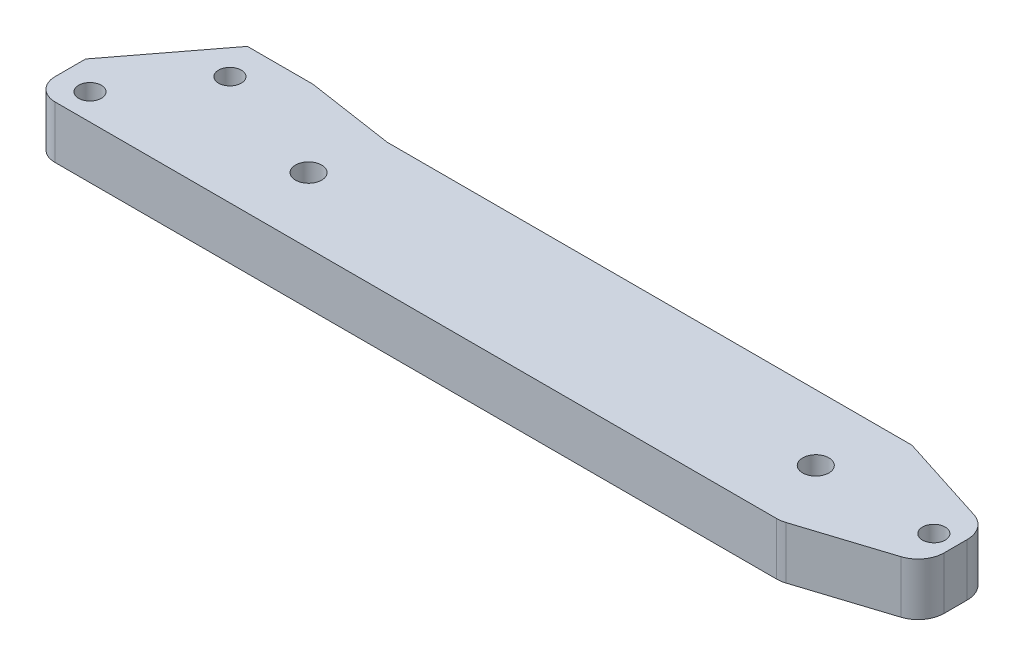
ISO-10303-21;
HEADER;
FILE_DESCRIPTION(('STEP AP214'),'2;1');
FILE_NAME('part.step','',(''),(''),'','','');
FILE_SCHEMA(('AUTOMOTIVE_DESIGN { 1 0 10303 214 1 1 1 1 }'));
ENDSEC;
DATA;
#1=APPLICATION_CONTEXT('core data for automotive mechanical design processes');
#2=APPLICATION_PROTOCOL_DEFINITION('international standard','automotive_design',2000,#1);
#3=PRODUCT_CONTEXT('',#1,'mechanical');
#4=PRODUCT('Part','Part','',(#3));
#5=PRODUCT_RELATED_PRODUCT_CATEGORY('part','',(#4));
#6=PRODUCT_DEFINITION_FORMATION('','',#4);
#7=PRODUCT_DEFINITION_CONTEXT('part definition',#1,'design');
#8=PRODUCT_DEFINITION('design','',#6,#7);
#9=PRODUCT_DEFINITION_SHAPE('','',#8);
#10=(LENGTH_UNIT() NAMED_UNIT(*) SI_UNIT(.MILLI.,.METRE.));
#11=(NAMED_UNIT(*) PLANE_ANGLE_UNIT() SI_UNIT($,.RADIAN.));
#12=(NAMED_UNIT(*) SI_UNIT($,.STERADIAN.) SOLID_ANGLE_UNIT());
#13=UNCERTAINTY_MEASURE_WITH_UNIT(LENGTH_MEASURE(1.E-05),#10,'distance_accuracy_value','');
#14=(GEOMETRIC_REPRESENTATION_CONTEXT(3) GLOBAL_UNCERTAINTY_ASSIGNED_CONTEXT((#13)) GLOBAL_UNIT_ASSIGNED_CONTEXT((#10,
#11,#12)) REPRESENTATION_CONTEXT('',''));
#15=CARTESIAN_POINT('',(0.,0.,0.));
#16=DIRECTION('',(0.,0.,1.));
#17=DIRECTION('',(1.,0.,0.));
#18=AXIS2_PLACEMENT_3D('',#15,#16,#17);
#19=CARTESIAN_POINT('',(0.,12.,0.));
#20=DIRECTION('',(0.,1.,0.));
#21=DIRECTION('',(0.,0.,1.));
#22=AXIS2_PLACEMENT_3D('',#19,#20,#21);
#23=PLANE('',#22);
#24=CARTESIAN_POINT('',(32.,12.,-15.));
#25=DIRECTION('',(0.,1.,0.));
#26=DIRECTION('',(0.,0.,1.));
#27=AXIS2_PLACEMENT_3D('',#24,#25,#26);
#28=CIRCLE('',#27,3.);
#29=CARTESIAN_POINT('',(32.,12.,-12.));
#30=VERTEX_POINT('',#29);
#31=EDGE_CURVE('E316',#30,#30,#28,.T.);
#32=ORIENTED_EDGE('',*,*,#31,.F.);
#33=EDGE_LOOP('',(#32));
#34=FACE_BOUND('',#33,.T.);
#35=CARTESIAN_POINT('',(-9.,12.,-6.));
#36=DIRECTION('',(0.,1.,0.));
#37=DIRECTION('',(0.,0.,1.));
#38=AXIS2_PLACEMENT_3D('',#35,#36,#37);
#39=CIRCLE('',#38,2.6);
#40=CARTESIAN_POINT('',(-9.,12.,-3.4));
#41=VERTEX_POINT('',#40);
#42=EDGE_CURVE('E304',#41,#41,#39,.T.);
#43=ORIENTED_EDGE('',*,*,#42,.F.);
#44=EDGE_LOOP('',(#43));
#45=FACE_BOUND('',#44,.T.);
#46=DIRECTION('',(1.,0.,0.));
#47=VECTOR('',#46,1.);
#48=CARTESIAN_POINT('',(0.,12.,0.));
#49=LINE('',#48,#47);
#50=CARTESIAN_POINT('',(-11.,12.,0.));
#51=VERTEX_POINT('',#50);
#52=CARTESIAN_POINT('',(154.06339287739,12.,0.));
#53=VERTEX_POINT('',#52);
#54=EDGE_CURVE('E185',#51,#53,#49,.T.);
#55=ORIENTED_EDGE('',*,*,#54,.T.);
#56=CARTESIAN_POINT('',(154.06339287739,12.,-6.));
#57=DIRECTION('',(0.,1.,0.));
#58=DIRECTION('',(0.,0.,1.));
#59=AXIS2_PLACEMENT_3D('',#56,#57,#58);
#60=CIRCLE('',#59,6.);
#61=CARTESIAN_POINT('',(155.892047240013,12.,-0.28545511680405));
#62=VERTEX_POINT('',#61);
#63=EDGE_CURVE('E219',#53,#62,#60,.T.);
#64=ORIENTED_EDGE('',*,*,#63,.T.);
#65=DIRECTION('',(0.952424147199324,0.,-0.304775727103784));
#66=VECTOR('',#65,1.);
#67=CARTESIAN_POINT('',(180.,12.,-8.));
#68=LINE('',#67,#66);
#69=CARTESIAN_POINT('',(175.828654362623,12.,-6.66516939603926));
#70=VERTEX_POINT('',#69);
#71=EDGE_CURVE('E295',#62,#70,#68,.T.);
#72=ORIENTED_EDGE('',*,*,#71,.T.);
#73=CARTESIAN_POINT('',(174.,12.,-12.3797142792352));
#74=DIRECTION('',(0.,1.,0.));
#75=DIRECTION('',(0.,0.,1.));
#76=AXIS2_PLACEMENT_3D('',#73,#74,#75);
#77=CIRCLE('',#76,6.);
#78=CARTESIAN_POINT('',(180.,12.,-12.3797142792352));
#79=VERTEX_POINT('',#78);
#80=EDGE_CURVE('E217',#70,#79,#77,.T.);
#81=ORIENTED_EDGE('',*,*,#80,.T.);
#82=DIRECTION('',(0.,0.,-1.));
#83=VECTOR('',#82,1.);
#84=CARTESIAN_POINT('',(180.,12.,-8.));
#85=LINE('',#84,#83);
#86=CARTESIAN_POINT('',(180.,12.,-17.6202857207648));
#87=VERTEX_POINT('',#86);
#88=EDGE_CURVE('E136',#79,#87,#85,.T.);
#89=ORIENTED_EDGE('',*,*,#88,.T.);
#90=CARTESIAN_POINT('',(174.,12.,-17.6202857207648));
#91=DIRECTION('',(0.,1.,0.));
#92=DIRECTION('',(0.,0.,1.));
#93=AXIS2_PLACEMENT_3D('',#90,#91,#92);
#94=CIRCLE('',#93,6.);
#95=CARTESIAN_POINT('',(175.828654362623,12.,-23.3348306039607));
#96=VERTEX_POINT('',#95);
#97=EDGE_CURVE('E48',#87,#96,#94,.T.);
#98=ORIENTED_EDGE('',*,*,#97,.T.);
#99=DIRECTION('',(-0.952424147199324,0.,-0.304775727103784));
#100=VECTOR('',#99,1.);
#101=CARTESIAN_POINT('',(180.,12.,-22.));
#102=LINE('',#101,#100);
#103=CARTESIAN_POINT('',(155.,12.,-30.));
#104=VERTEX_POINT('',#103);
#105=EDGE_CURVE('E127',#96,#104,#102,.T.);
#106=ORIENTED_EDGE('',*,*,#105,.T.);
#107=DIRECTION('',(-1.,0.,0.));
#108=VECTOR('',#107,1.);
#109=CARTESIAN_POINT('',(35.,12.,-30.));
#110=LINE('',#109,#108);
#111=CARTESIAN_POINT('',(35.,12.,-30.));
#112=VERTEX_POINT('',#111);
#113=EDGE_CURVE('E132',#104,#112,#110,.T.);
#114=ORIENTED_EDGE('',*,*,#113,.T.);
#115=DIRECTION('',(-0.988936352868298,0.,-0.148340452930245));
#116=VECTOR('',#115,1.);
#117=CARTESIAN_POINT('',(15.,12.,-33.));
#118=LINE('',#117,#116);
#119=CARTESIAN_POINT('',(15.,12.,-33.));
#120=VERTEX_POINT('',#119);
#121=EDGE_CURVE('E151',#112,#120,#118,.T.);
#122=ORIENTED_EDGE('',*,*,#121,.T.);
#123=DIRECTION('',(-1.,0.,0.));
#124=VECTOR('',#123,1.);
#125=CARTESIAN_POINT('',(0.,12.,-33.));
#126=LINE('',#125,#124);
#127=CARTESIAN_POINT('',(0.,12.,-33.));
#128=VERTEX_POINT('',#127);
#129=EDGE_CURVE('E153',#120,#128,#126,.T.);
#130=ORIENTED_EDGE('',*,*,#129,.T.);
#131=DIRECTION('',(-0.606043215262856,0.,0.795431720032499));
#132=VECTOR('',#131,1.);
#133=CARTESIAN_POINT('',(-16.,12.,-12.));
#134=LINE('',#133,#132);
#135=CARTESIAN_POINT('',(-16.,12.,-12.));
#136=VERTEX_POINT('',#135);
#137=EDGE_CURVE('E158',#128,#136,#134,.T.);
#138=ORIENTED_EDGE('',*,*,#137,.T.);
#139=DIRECTION('',(0.,0.,1.));
#140=VECTOR('',#139,1.);
#141=CARTESIAN_POINT('',(-16.,12.,-12.));
#142=LINE('',#141,#140);
#143=CARTESIAN_POINT('',(-16.,12.,-5.));
#144=VERTEX_POINT('',#143);
#145=EDGE_CURVE('E160',#136,#144,#142,.T.);
#146=ORIENTED_EDGE('',*,*,#145,.T.);
#147=CARTESIAN_POINT('',(-11.,12.,-5.));
#148=DIRECTION('',(0.,1.,0.));
#149=DIRECTION('',(0.,0.,1.));
#150=AXIS2_PLACEMENT_3D('',#147,#148,#149);
#151=CIRCLE('',#150,5.);
#152=EDGE_CURVE('E201',#144,#51,#151,.T.);
#153=ORIENTED_EDGE('',*,*,#152,.T.);
#154=EDGE_LOOP('',(#55,#64,#72,#81,#89,#98,#106,#114,#122,#130,#138,#146,#153));
#155=FACE_BOUND('',#154,.T.);
#156=CARTESIAN_POINT('',(175.,12.,-15.));
#157=DIRECTION('',(0.,1.,0.));
#158=DIRECTION('',(0.,0.,1.));
#159=AXIS2_PLACEMENT_3D('',#156,#157,#158);
#160=CIRCLE('',#159,2.59999999999999);
#161=CARTESIAN_POINT('',(175.,12.,-12.4));
#162=VERTEX_POINT('',#161);
#163=EDGE_CURVE('E168',#162,#162,#160,.T.);
#164=ORIENTED_EDGE('',*,*,#163,.F.);
#165=EDGE_LOOP('',(#164));
#166=FACE_BOUND('',#165,.T.);
#167=CARTESIAN_POINT('',(148.,12.,-15.));
#168=DIRECTION('',(0.,1.,0.));
#169=DIRECTION('',(0.,0.,1.));
#170=AXIS2_PLACEMENT_3D('',#167,#168,#169);
#171=CIRCLE('',#170,2.99999999999999);
#172=CARTESIAN_POINT('',(148.,12.,-12.));
#173=VERTEX_POINT('',#172);
#174=EDGE_CURVE('E310',#173,#173,#171,.T.);
#175=ORIENTED_EDGE('',*,*,#174,.F.);
#176=EDGE_LOOP('',(#175));
#177=FACE_BOUND('',#176,.T.);
#178=CARTESIAN_POINT('',(4.,12.,-25.));
#179=DIRECTION('',(0.,1.,0.));
#180=DIRECTION('',(0.,0.,1.));
#181=AXIS2_PLACEMENT_3D('',#178,#179,#180);
#182=CIRCLE('',#181,2.6);
#183=CARTESIAN_POINT('',(4.,12.,-22.4));
#184=VERTEX_POINT('',#183);
#185=EDGE_CURVE('E322',#184,#184,#182,.T.);
#186=ORIENTED_EDGE('',*,*,#185,.F.);
#187=EDGE_LOOP('',(#186));
#188=FACE_BOUND('',#187,.T.);
#189=ADVANCED_FACE('F33',(#34,#45,#155,#166,#177,#188),#23,.T.);
#190=CARTESIAN_POINT('',(0.,0.,0.));
#191=DIRECTION('',(0.,1.,0.));
#192=DIRECTION('',(0.,0.,1.));
#193=AXIS2_PLACEMENT_3D('',#190,#191,#192);
#194=PLANE('',#193);
#195=DIRECTION('',(0.952424147199324,0.,-0.304775727103784));
#196=VECTOR('',#195,1.);
#197=CARTESIAN_POINT('',(180.,0.,-8.));
#198=LINE('',#197,#196);
#199=CARTESIAN_POINT('',(155.892047240013,0.,-0.28545511680405));
#200=VERTEX_POINT('',#199);
#201=CARTESIAN_POINT('',(175.828654362623,0.,-6.66516939603926));
#202=VERTEX_POINT('',#201);
#203=EDGE_CURVE('E164',#200,#202,#198,.T.);
#204=ORIENTED_EDGE('',*,*,#203,.F.);
#205=CARTESIAN_POINT('',(154.06339287739,0.,-6.));
#206=DIRECTION('',(0.,1.,0.));
#207=DIRECTION('',(0.,0.,1.));
#208=AXIS2_PLACEMENT_3D('',#205,#206,#207);
#209=CIRCLE('',#208,6.);
#210=CARTESIAN_POINT('',(154.06339287739,0.,0.));
#211=VERTEX_POINT('',#210);
#212=EDGE_CURVE('E212',#200,#211,#209,.F.);
#213=ORIENTED_EDGE('',*,*,#212,.T.);
#214=DIRECTION('',(1.,0.,0.));
#215=VECTOR('',#214,1.);
#216=CARTESIAN_POINT('',(-16.,0.,0.));
#217=LINE('',#216,#215);
#218=CARTESIAN_POINT('',(-11.,0.,0.));
#219=VERTEX_POINT('',#218);
#220=EDGE_CURVE('E182',#219,#211,#217,.T.);
#221=ORIENTED_EDGE('',*,*,#220,.F.);
#222=CARTESIAN_POINT('',(-11.,0.,-5.));
#223=DIRECTION('',(0.,1.,0.));
#224=DIRECTION('',(0.,0.,1.));
#225=AXIS2_PLACEMENT_3D('',#222,#223,#224);
#226=CIRCLE('',#225,5.);
#227=CARTESIAN_POINT('',(-16.,0.,-5.));
#228=VERTEX_POINT('',#227);
#229=EDGE_CURVE('E197',#219,#228,#226,.F.);
#230=ORIENTED_EDGE('',*,*,#229,.T.);
#231=DIRECTION('',(0.,0.,1.));
#232=VECTOR('',#231,1.);
#233=CARTESIAN_POINT('',(-16.,0.,-12.));
#234=LINE('',#233,#232);
#235=CARTESIAN_POINT('',(-16.,0.,-12.));
#236=VERTEX_POINT('',#235);
#237=EDGE_CURVE('E179',#236,#228,#234,.T.);
#238=ORIENTED_EDGE('',*,*,#237,.F.);
#239=DIRECTION('',(-0.606043215262856,0.,0.795431720032499));
#240=VECTOR('',#239,1.);
#241=CARTESIAN_POINT('',(-16.,0.,-12.));
#242=LINE('',#241,#240);
#243=CARTESIAN_POINT('',(0.,0.,-33.));
#244=VERTEX_POINT('',#243);
#245=EDGE_CURVE('E177',#244,#236,#242,.T.);
#246=ORIENTED_EDGE('',*,*,#245,.F.);
#247=DIRECTION('',(-1.,0.,0.));
#248=VECTOR('',#247,1.);
#249=CARTESIAN_POINT('',(0.,0.,-33.));
#250=LINE('',#249,#248);
#251=CARTESIAN_POINT('',(15.,0.,-33.));
#252=VERTEX_POINT('',#251);
#253=EDGE_CURVE('E175',#252,#244,#250,.T.);
#254=ORIENTED_EDGE('',*,*,#253,.F.);
#255=DIRECTION('',(-0.988936352868298,0.,-0.148340452930245));
#256=VECTOR('',#255,1.);
#257=CARTESIAN_POINT('',(15.,0.,-33.));
#258=LINE('',#257,#256);
#259=CARTESIAN_POINT('',(35.,0.,-30.));
#260=VERTEX_POINT('',#259);
#261=EDGE_CURVE('E173',#260,#252,#258,.T.);
#262=ORIENTED_EDGE('',*,*,#261,.F.);
#263=DIRECTION('',(-1.,0.,0.));
#264=VECTOR('',#263,1.);
#265=CARTESIAN_POINT('',(35.,0.,-30.));
#266=LINE('',#265,#264);
#267=CARTESIAN_POINT('',(155.,0.,-30.));
#268=VERTEX_POINT('',#267);
#269=EDGE_CURVE('E171',#268,#260,#266,.T.);
#270=ORIENTED_EDGE('',*,*,#269,.F.);
#271=DIRECTION('',(-0.952424147199324,0.,-0.304775727103784));
#272=VECTOR('',#271,1.);
#273=CARTESIAN_POINT('',(180.,0.,-22.));
#274=LINE('',#273,#272);
#275=CARTESIAN_POINT('',(175.828654362623,0.,-23.3348306039607));
#276=VERTEX_POINT('',#275);
#277=EDGE_CURVE('E142',#276,#268,#274,.T.);
#278=ORIENTED_EDGE('',*,*,#277,.F.);
#279=CARTESIAN_POINT('',(174.,0.,-17.6202857207648));
#280=DIRECTION('',(0.,1.,0.));
#281=DIRECTION('',(0.,0.,1.));
#282=AXIS2_PLACEMENT_3D('',#279,#280,#281);
#283=CIRCLE('',#282,6.);
#284=CARTESIAN_POINT('',(180.,0.,-17.6202857207648));
#285=VERTEX_POINT('',#284);
#286=EDGE_CURVE('E208',#276,#285,#283,.F.);
#287=ORIENTED_EDGE('',*,*,#286,.T.);
#288=DIRECTION('',(0.,0.,-1.));
#289=VECTOR('',#288,1.);
#290=CARTESIAN_POINT('',(180.,0.,-8.));
#291=LINE('',#290,#289);
#292=CARTESIAN_POINT('',(180.,0.,-12.3797142792352));
#293=VERTEX_POINT('',#292);
#294=EDGE_CURVE('E167',#293,#285,#291,.T.);
#295=ORIENTED_EDGE('',*,*,#294,.F.);
#296=CARTESIAN_POINT('',(174.,0.,-12.3797142792352));
#297=DIRECTION('',(0.,1.,0.));
#298=DIRECTION('',(0.,0.,1.));
#299=AXIS2_PLACEMENT_3D('',#296,#297,#298);
#300=CIRCLE('',#299,6.);
#301=EDGE_CURVE('E210',#293,#202,#300,.F.);
#302=ORIENTED_EDGE('',*,*,#301,.T.);
#303=EDGE_LOOP('',(#204,#213,#221,#230,#238,#246,#254,#262,#270,#278,#287,#295,#302));
#304=FACE_BOUND('',#303,.T.);
#305=CARTESIAN_POINT('',(175.,0.,-15.));
#306=DIRECTION('',(0.,1.,0.));
#307=DIRECTION('',(0.,0.,1.));
#308=AXIS2_PLACEMENT_3D('',#305,#306,#307);
#309=CIRCLE('',#308,2.59999999999999);
#310=CARTESIAN_POINT('',(175.,0.,-12.4));
#311=VERTEX_POINT('',#310);
#312=EDGE_CURVE('E301',#311,#311,#309,.T.);
#313=ORIENTED_EDGE('',*,*,#312,.T.);
#314=EDGE_LOOP('',(#313));
#315=FACE_BOUND('',#314,.T.);
#316=CARTESIAN_POINT('',(-9.,0.,-6.));
#317=DIRECTION('',(0.,1.,0.));
#318=DIRECTION('',(0.,0.,1.));
#319=AXIS2_PLACEMENT_3D('',#316,#317,#318);
#320=CIRCLE('',#319,2.6);
#321=CARTESIAN_POINT('',(-9.,0.,-3.4));
#322=VERTEX_POINT('',#321);
#323=EDGE_CURVE('E307',#322,#322,#320,.T.);
#324=ORIENTED_EDGE('',*,*,#323,.T.);
#325=EDGE_LOOP('',(#324));
#326=FACE_BOUND('',#325,.T.);
#327=CARTESIAN_POINT('',(148.,0.,-15.));
#328=DIRECTION('',(0.,1.,0.));
#329=DIRECTION('',(0.,0.,1.));
#330=AXIS2_PLACEMENT_3D('',#327,#328,#329);
#331=CIRCLE('',#330,2.99999999999999);
#332=CARTESIAN_POINT('',(148.,0.,-12.));
#333=VERTEX_POINT('',#332);
#334=EDGE_CURVE('E313',#333,#333,#331,.T.);
#335=ORIENTED_EDGE('',*,*,#334,.T.);
#336=EDGE_LOOP('',(#335));
#337=FACE_BOUND('',#336,.T.);
#338=CARTESIAN_POINT('',(32.,0.,-15.));
#339=DIRECTION('',(0.,1.,0.));
#340=DIRECTION('',(0.,0.,1.));
#341=AXIS2_PLACEMENT_3D('',#338,#339,#340);
#342=CIRCLE('',#341,3.);
#343=CARTESIAN_POINT('',(32.,0.,-12.));
#344=VERTEX_POINT('',#343);
#345=EDGE_CURVE('E319',#344,#344,#342,.T.);
#346=ORIENTED_EDGE('',*,*,#345,.T.);
#347=EDGE_LOOP('',(#346));
#348=FACE_BOUND('',#347,.T.);
#349=CARTESIAN_POINT('',(4.,0.,-25.));
#350=DIRECTION('',(0.,1.,0.));
#351=DIRECTION('',(0.,0.,1.));
#352=AXIS2_PLACEMENT_3D('',#349,#350,#351);
#353=CIRCLE('',#352,2.6);
#354=CARTESIAN_POINT('',(4.,0.,-22.4));
#355=VERTEX_POINT('',#354);
#356=EDGE_CURVE('E325',#355,#355,#353,.T.);
#357=ORIENTED_EDGE('',*,*,#356,.T.);
#358=EDGE_LOOP('',(#357));
#359=FACE_BOUND('',#358,.T.);
#360=ADVANCED_FACE('F229',(#304,#315,#326,#337,#348,#359),#194,.F.);
#361=CARTESIAN_POINT('',(180.,12.,-8.));
#362=DIRECTION('',(-0.304775727103784,0.,-0.952424147199324));
#363=DIRECTION('',(-0.952424147199324,0.,0.304775727103784));
#364=AXIS2_PLACEMENT_3D('',#361,#362,#363);
#365=PLANE('',#364);
#366=ORIENTED_EDGE('',*,*,#71,.F.);
#367=DIRECTION('',(0.,-1.,0.));
#368=VECTOR('',#367,1.);
#369=CARTESIAN_POINT('',(155.892047240013,12.,-0.285455116804052));
#370=LINE('',#369,#368);
#371=EDGE_CURVE('E205',#62,#200,#370,.T.);
#372=ORIENTED_EDGE('',*,*,#371,.T.);
#373=ORIENTED_EDGE('',*,*,#203,.T.);
#374=DIRECTION('',(0.,-1.,0.));
#375=VECTOR('',#374,1.);
#376=CARTESIAN_POINT('',(175.828654362623,12.,-6.66516939603926));
#377=LINE('',#376,#375);
#378=EDGE_CURVE('E203',#202,#70,#377,.F.);
#379=ORIENTED_EDGE('',*,*,#378,.T.);
#380=EDGE_LOOP('',(#366,#372,#373,#379));
#381=FACE_BOUND('',#380,.T.);
#382=ADVANCED_FACE('F244',(#381),#365,.F.);
#383=CARTESIAN_POINT('',(180.,12.,-8.));
#384=DIRECTION('',(-1.,0.,0.));
#385=DIRECTION('',(0.,0.,1.));
#386=AXIS2_PLACEMENT_3D('',#383,#384,#385);
#387=PLANE('',#386);
#388=ORIENTED_EDGE('',*,*,#88,.F.);
#389=DIRECTION('',(0.,-1.,0.));
#390=VECTOR('',#389,1.);
#391=CARTESIAN_POINT('',(180.,12.,-12.3797142792352));
#392=LINE('',#391,#390);
#393=EDGE_CURVE('E41',#79,#293,#392,.T.);
#394=ORIENTED_EDGE('',*,*,#393,.T.);
#395=ORIENTED_EDGE('',*,*,#294,.T.);
#396=DIRECTION('',(0.,-1.,0.));
#397=VECTOR('',#396,1.);
#398=CARTESIAN_POINT('',(180.,12.,-17.6202857207648));
#399=LINE('',#398,#397);
#400=EDGE_CURVE('E56',#285,#87,#399,.F.);
#401=ORIENTED_EDGE('',*,*,#400,.T.);
#402=EDGE_LOOP('',(#388,#394,#395,#401));
#403=FACE_BOUND('',#402,.T.);
#404=ADVANCED_FACE('F224',(#403),#387,.F.);
#405=CARTESIAN_POINT('',(180.,12.,-22.));
#406=DIRECTION('',(-0.304775727103784,0.,0.952424147199324));
#407=DIRECTION('',(0.952424147199324,0.,0.304775727103784));
#408=AXIS2_PLACEMENT_3D('',#405,#406,#407);
#409=PLANE('',#408);
#410=ORIENTED_EDGE('',*,*,#105,.F.);
#411=DIRECTION('',(0.,-1.,0.));
#412=VECTOR('',#411,1.);
#413=CARTESIAN_POINT('',(175.828654362623,12.,-23.3348306039607));
#414=LINE('',#413,#412);
#415=EDGE_CURVE('E11',#96,#276,#414,.T.);
#416=ORIENTED_EDGE('',*,*,#415,.T.);
#417=ORIENTED_EDGE('',*,*,#277,.T.);
#418=DIRECTION('',(0.,-1.,0.));
#419=VECTOR('',#418,1.);
#420=CARTESIAN_POINT('',(155.,12.,-30.));
#421=LINE('',#420,#419);
#422=EDGE_CURVE('E139',#104,#268,#421,.T.);
#423=ORIENTED_EDGE('',*,*,#422,.F.);
#424=EDGE_LOOP('',(#410,#416,#417,#423));
#425=FACE_BOUND('',#424,.T.);
#426=ADVANCED_FACE('F140',(#425),#409,.F.);
#427=CARTESIAN_POINT('',(35.,12.,-30.));
#428=DIRECTION('',(0.,0.,1.));
#429=DIRECTION('',(1.,0.,0.));
#430=AXIS2_PLACEMENT_3D('',#427,#428,#429);
#431=PLANE('',#430);
#432=ORIENTED_EDGE('',*,*,#269,.T.);
#433=DIRECTION('',(0.,-1.,0.));
#434=VECTOR('',#433,1.);
#435=CARTESIAN_POINT('',(35.,12.,-30.));
#436=LINE('',#435,#434);
#437=EDGE_CURVE('E146',#112,#260,#436,.T.);
#438=ORIENTED_EDGE('',*,*,#437,.F.);
#439=ORIENTED_EDGE('',*,*,#113,.F.);
#440=ORIENTED_EDGE('',*,*,#422,.T.);
#441=EDGE_LOOP('',(#432,#438,#439,#440));
#442=FACE_BOUND('',#441,.T.);
#443=ADVANCED_FACE('F148',(#442),#431,.F.);
#444=CARTESIAN_POINT('',(15.,12.,-33.));
#445=DIRECTION('',(-0.148340452930245,0.,0.988936352868298));
#446=DIRECTION('',(0.988936352868298,0.,0.148340452930245));
#447=AXIS2_PLACEMENT_3D('',#444,#445,#446);
#448=PLANE('',#447);
#449=ORIENTED_EDGE('',*,*,#261,.T.);
#450=DIRECTION('',(0.,-1.,0.));
#451=VECTOR('',#450,1.);
#452=CARTESIAN_POINT('',(15.,12.,-33.));
#453=LINE('',#452,#451);
#454=EDGE_CURVE('E191',#120,#252,#453,.T.);
#455=ORIENTED_EDGE('',*,*,#454,.F.);
#456=ORIENTED_EDGE('',*,*,#121,.F.);
#457=ORIENTED_EDGE('',*,*,#437,.T.);
#458=EDGE_LOOP('',(#449,#455,#456,#457));
#459=FACE_BOUND('',#458,.T.);
#460=ADVANCED_FACE('F267',(#459),#448,.F.);
#461=CARTESIAN_POINT('',(0.,12.,-33.));
#462=DIRECTION('',(0.,0.,1.));
#463=DIRECTION('',(1.,0.,0.));
#464=AXIS2_PLACEMENT_3D('',#461,#462,#463);
#465=PLANE('',#464);
#466=ORIENTED_EDGE('',*,*,#253,.T.);
#467=DIRECTION('',(0.,-1.,0.));
#468=VECTOR('',#467,1.);
#469=CARTESIAN_POINT('',(0.,12.,-33.));
#470=LINE('',#469,#468);
#471=EDGE_CURVE('E188',#128,#244,#470,.T.);
#472=ORIENTED_EDGE('',*,*,#471,.F.);
#473=ORIENTED_EDGE('',*,*,#129,.F.);
#474=ORIENTED_EDGE('',*,*,#454,.T.);
#475=EDGE_LOOP('',(#466,#472,#473,#474));
#476=FACE_BOUND('',#475,.T.);
#477=ADVANCED_FACE('F263',(#476),#465,.F.);
#478=CARTESIAN_POINT('',(-16.,12.,-12.));
#479=DIRECTION('',(0.795431720032499,0.,0.606043215262856));
#480=DIRECTION('',(0.606043215262856,0.,-0.795431720032499));
#481=AXIS2_PLACEMENT_3D('',#478,#479,#480);
#482=PLANE('',#481);
#483=ORIENTED_EDGE('',*,*,#245,.T.);
#484=DIRECTION('',(0.,-1.,0.));
#485=VECTOR('',#484,1.);
#486=CARTESIAN_POINT('',(-16.,12.,-12.));
#487=LINE('',#486,#485);
#488=EDGE_CURVE('E163',#136,#236,#487,.T.);
#489=ORIENTED_EDGE('',*,*,#488,.F.);
#490=ORIENTED_EDGE('',*,*,#137,.F.);
#491=ORIENTED_EDGE('',*,*,#471,.T.);
#492=EDGE_LOOP('',(#483,#489,#490,#491));
#493=FACE_BOUND('',#492,.T.);
#494=ADVANCED_FACE('F259',(#493),#482,.F.);
#495=CARTESIAN_POINT('',(-16.,12.,-12.));
#496=DIRECTION('',(1.,0.,0.));
#497=DIRECTION('',(0.,0.,-1.));
#498=AXIS2_PLACEMENT_3D('',#495,#496,#497);
#499=PLANE('',#498);
#500=ORIENTED_EDGE('',*,*,#237,.T.);
#501=DIRECTION('',(0.,-1.,0.));
#502=VECTOR('',#501,1.);
#503=CARTESIAN_POINT('',(-16.,12.,-5.));
#504=LINE('',#503,#502);
#505=EDGE_CURVE('E199',#228,#144,#504,.F.);
#506=ORIENTED_EDGE('',*,*,#505,.T.);
#507=ORIENTED_EDGE('',*,*,#145,.F.);
#508=ORIENTED_EDGE('',*,*,#488,.T.);
#509=EDGE_LOOP('',(#500,#506,#507,#508));
#510=FACE_BOUND('',#509,.T.);
#511=ADVANCED_FACE('F255',(#510),#499,.F.);
#512=CARTESIAN_POINT('',(-16.,12.,0.));
#513=DIRECTION('',(0.,0.,-1.));
#514=DIRECTION('',(-1.,0.,0.));
#515=AXIS2_PLACEMENT_3D('',#512,#513,#514);
#516=PLANE('',#515);
#517=ORIENTED_EDGE('',*,*,#220,.T.);
#518=DIRECTION('',(0.,-1.,0.));
#519=VECTOR('',#518,1.);
#520=CARTESIAN_POINT('',(154.06339287739,12.,0.));
#521=LINE('',#520,#519);
#522=EDGE_CURVE('E214',#211,#53,#521,.F.);
#523=ORIENTED_EDGE('',*,*,#522,.T.);
#524=ORIENTED_EDGE('',*,*,#54,.F.);
#525=DIRECTION('',(0.,-1.,0.));
#526=VECTOR('',#525,1.);
#527=CARTESIAN_POINT('',(-11.,12.,0.));
#528=LINE('',#527,#526);
#529=EDGE_CURVE('E145',#51,#219,#528,.T.);
#530=ORIENTED_EDGE('',*,*,#529,.T.);
#531=EDGE_LOOP('',(#517,#523,#524,#530));
#532=FACE_BOUND('',#531,.T.);
#533=ADVANCED_FACE('F252',(#532),#516,.F.);
#534=CARTESIAN_POINT('',(175.,12.,-15.));
#535=DIRECTION('',(0.,-1.,0.));
#536=DIRECTION('',(0.,0.,-1.));
#537=AXIS2_PLACEMENT_3D('',#534,#535,#536);
#538=CYLINDRICAL_SURFACE('',#537,2.59999999999999);
#539=ORIENTED_EDGE('',*,*,#163,.T.);
#540=EDGE_LOOP('',(#539));
#541=FACE_BOUND('',#540,.T.);
#542=ORIENTED_EDGE('',*,*,#312,.F.);
#543=EDGE_LOOP('',(#542));
#544=FACE_BOUND('',#543,.T.);
#545=ADVANCED_FACE('F249',(#541,#544),#538,.F.);
#546=CARTESIAN_POINT('',(-9.,12.,-6.));
#547=DIRECTION('',(0.,-1.,0.));
#548=DIRECTION('',(0.,0.,-1.));
#549=AXIS2_PLACEMENT_3D('',#546,#547,#548);
#550=CYLINDRICAL_SURFACE('',#549,2.6);
#551=ORIENTED_EDGE('',*,*,#42,.T.);
#552=EDGE_LOOP('',(#551));
#553=FACE_BOUND('',#552,.T.);
#554=ORIENTED_EDGE('',*,*,#323,.F.);
#555=EDGE_LOOP('',(#554));
#556=FACE_BOUND('',#555,.T.);
#557=ADVANCED_FACE('F346',(#553,#556),#550,.F.);
#558=CARTESIAN_POINT('',(148.,12.,-15.));
#559=DIRECTION('',(0.,-1.,0.));
#560=DIRECTION('',(0.,0.,-1.));
#561=AXIS2_PLACEMENT_3D('',#558,#559,#560);
#562=CYLINDRICAL_SURFACE('',#561,2.99999999999999);
#563=ORIENTED_EDGE('',*,*,#174,.T.);
#564=EDGE_LOOP('',(#563));
#565=FACE_BOUND('',#564,.T.);
#566=ORIENTED_EDGE('',*,*,#334,.F.);
#567=EDGE_LOOP('',(#566));
#568=FACE_BOUND('',#567,.T.);
#569=ADVANCED_FACE('F341',(#565,#568),#562,.F.);
#570=CARTESIAN_POINT('',(32.,12.,-15.));
#571=DIRECTION('',(0.,-1.,0.));
#572=DIRECTION('',(0.,0.,-1.));
#573=AXIS2_PLACEMENT_3D('',#570,#571,#572);
#574=CYLINDRICAL_SURFACE('',#573,3.);
#575=ORIENTED_EDGE('',*,*,#31,.T.);
#576=EDGE_LOOP('',(#575));
#577=FACE_BOUND('',#576,.T.);
#578=ORIENTED_EDGE('',*,*,#345,.F.);
#579=EDGE_LOOP('',(#578));
#580=FACE_BOUND('',#579,.T.);
#581=ADVANCED_FACE('F334',(#577,#580),#574,.F.);
#582=CARTESIAN_POINT('',(4.,12.,-25.));
#583=DIRECTION('',(0.,-1.,0.));
#584=DIRECTION('',(0.,0.,-1.));
#585=AXIS2_PLACEMENT_3D('',#582,#583,#584);
#586=CYLINDRICAL_SURFACE('',#585,2.6);
#587=ORIENTED_EDGE('',*,*,#185,.T.);
#588=EDGE_LOOP('',(#587));
#589=FACE_BOUND('',#588,.T.);
#590=ORIENTED_EDGE('',*,*,#356,.F.);
#591=EDGE_LOOP('',(#590));
#592=FACE_BOUND('',#591,.T.);
#593=ADVANCED_FACE('F284',(#589,#592),#586,.F.);
#594=CARTESIAN_POINT('',(-11.,12.,-5.));
#595=DIRECTION('',(0.,-1.,0.));
#596=DIRECTION('',(0.,0.,-1.));
#597=AXIS2_PLACEMENT_3D('',#594,#595,#596);
#598=CYLINDRICAL_SURFACE('',#597,5.);
#599=ORIENTED_EDGE('',*,*,#152,.F.);
#600=ORIENTED_EDGE('',*,*,#505,.F.);
#601=ORIENTED_EDGE('',*,*,#229,.F.);
#602=ORIENTED_EDGE('',*,*,#529,.F.);
#603=EDGE_LOOP('',(#599,#600,#601,#602));
#604=FACE_BOUND('',#603,.T.);
#605=ADVANCED_FACE('F281',(#604),#598,.T.);
#606=CARTESIAN_POINT('',(154.06339287739,12.,-6.));
#607=DIRECTION('',(0.,-1.,0.));
#608=DIRECTION('',(0.,0.,-1.));
#609=AXIS2_PLACEMENT_3D('',#606,#607,#608);
#610=CYLINDRICAL_SURFACE('',#609,6.);
#611=ORIENTED_EDGE('',*,*,#63,.F.);
#612=ORIENTED_EDGE('',*,*,#522,.F.);
#613=ORIENTED_EDGE('',*,*,#212,.F.);
#614=ORIENTED_EDGE('',*,*,#371,.F.);
#615=EDGE_LOOP('',(#611,#612,#613,#614));
#616=FACE_BOUND('',#615,.T.);
#617=ADVANCED_FACE('F237',(#616),#610,.T.);
#618=CARTESIAN_POINT('',(174.,12.,-12.3797142792352));
#619=DIRECTION('',(0.,-1.,0.));
#620=DIRECTION('',(0.,0.,-1.));
#621=AXIS2_PLACEMENT_3D('',#618,#619,#620);
#622=CYLINDRICAL_SURFACE('',#621,6.);
#623=ORIENTED_EDGE('',*,*,#80,.F.);
#624=ORIENTED_EDGE('',*,*,#378,.F.);
#625=ORIENTED_EDGE('',*,*,#301,.F.);
#626=ORIENTED_EDGE('',*,*,#393,.F.);
#627=EDGE_LOOP('',(#623,#624,#625,#626));
#628=FACE_BOUND('',#627,.T.);
#629=ADVANCED_FACE('F233',(#628),#622,.T.);
#630=CARTESIAN_POINT('',(174.,12.,-17.6202857207648));
#631=DIRECTION('',(0.,-1.,0.));
#632=DIRECTION('',(0.,0.,-1.));
#633=AXIS2_PLACEMENT_3D('',#630,#631,#632);
#634=CYLINDRICAL_SURFACE('',#633,6.);
#635=ORIENTED_EDGE('',*,*,#97,.F.);
#636=ORIENTED_EDGE('',*,*,#400,.F.);
#637=ORIENTED_EDGE('',*,*,#286,.F.);
#638=ORIENTED_EDGE('',*,*,#415,.F.);
#639=EDGE_LOOP('',(#635,#636,#637,#638));
#640=FACE_BOUND('',#639,.T.);
#641=ADVANCED_FACE('F35',(#640),#634,.T.);
#642=CLOSED_SHELL('',(#189,#360,#382,#404,#426,#443,#460,#477,#494,#511,#533,#545,#557,#569,
#581,#593,#605,#617,#629,#641));
#643=MANIFOLD_SOLID_BREP('B2',#642);
#644=ADVANCED_BREP_SHAPE_REPRESENTATION('',(#18,#643),#14);
#645=SHAPE_DEFINITION_REPRESENTATION(#9,#644);
ENDSEC;
END-ISO-10303-21;
